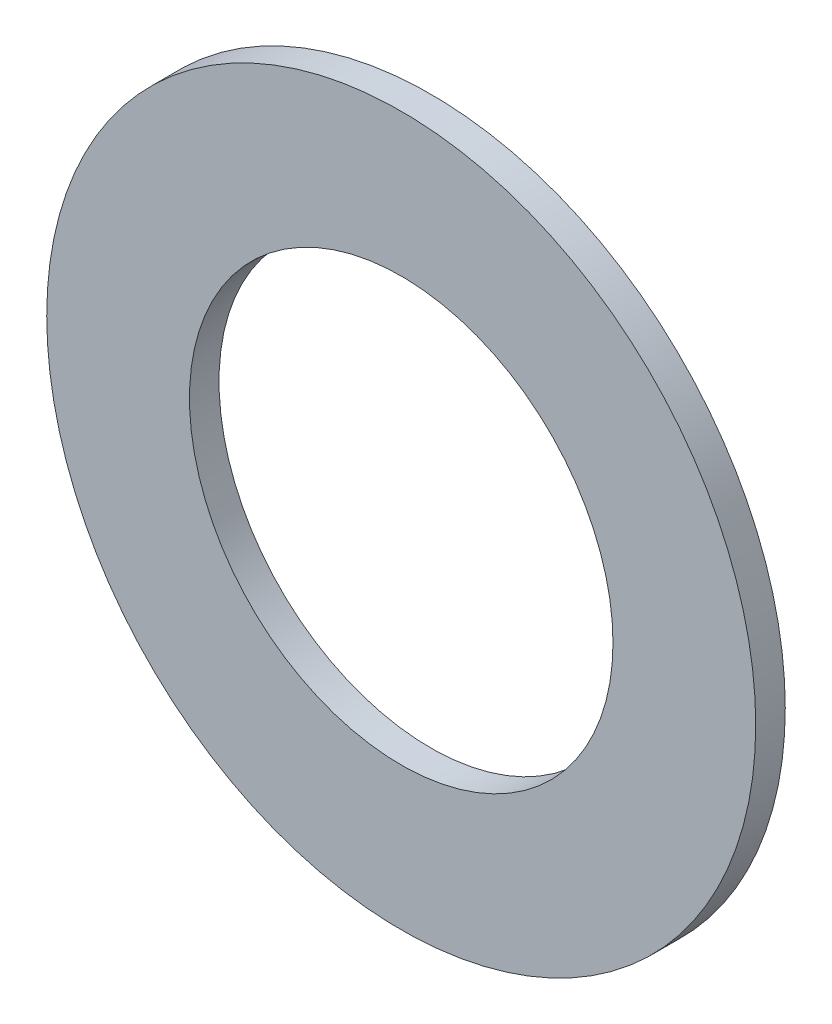
ISO-10303-21;
HEADER;
FILE_DESCRIPTION(('STEP AP214'),'2;1');
FILE_NAME('part.step','',(''),(''),'','','');
FILE_SCHEMA(('AUTOMOTIVE_DESIGN { 1 0 10303 214 1 1 1 1 }'));
ENDSEC;
DATA;
#1=APPLICATION_CONTEXT('core data for automotive mechanical design processes');
#2=APPLICATION_PROTOCOL_DEFINITION('international standard','automotive_design',2000,#1);
#3=PRODUCT_CONTEXT('',#1,'mechanical');
#4=PRODUCT('Part','Part','',(#3));
#5=PRODUCT_RELATED_PRODUCT_CATEGORY('part','',(#4));
#6=PRODUCT_DEFINITION_FORMATION('','',#4);
#7=PRODUCT_DEFINITION_CONTEXT('part definition',#1,'design');
#8=PRODUCT_DEFINITION('design','',#6,#7);
#9=PRODUCT_DEFINITION_SHAPE('','',#8);
#10=(LENGTH_UNIT() NAMED_UNIT(*) SI_UNIT(.MILLI.,.METRE.));
#11=(NAMED_UNIT(*) PLANE_ANGLE_UNIT() SI_UNIT($,.RADIAN.));
#12=(NAMED_UNIT(*) SI_UNIT($,.STERADIAN.) SOLID_ANGLE_UNIT());
#13=UNCERTAINTY_MEASURE_WITH_UNIT(LENGTH_MEASURE(1.E-05),#10,'distance_accuracy_value','');
#14=(GEOMETRIC_REPRESENTATION_CONTEXT(3) GLOBAL_UNCERTAINTY_ASSIGNED_CONTEXT((#13)) GLOBAL_UNIT_ASSIGNED_CONTEXT((#10,
#11,#12)) REPRESENTATION_CONTEXT('',''));
#15=CARTESIAN_POINT('',(0.,0.,0.));
#16=DIRECTION('',(0.,0.,1.));
#17=DIRECTION('',(1.,0.,0.));
#18=AXIS2_PLACEMENT_3D('',#15,#16,#17);
#19=CARTESIAN_POINT('',(0.,0.,0.79375));
#20=DIRECTION('',(0.,0.,1.));
#21=DIRECTION('',(1.,0.,0.));
#22=AXIS2_PLACEMENT_3D('',#19,#20,#21);
#23=PLANE('',#22);
#24=CARTESIAN_POINT('',(0.,0.,0.79375));
#25=DIRECTION('',(0.,0.,1.));
#26=DIRECTION('',(1.,0.,0.));
#27=AXIS2_PLACEMENT_3D('',#24,#25,#26);
#28=CIRCLE('',#27,19.05);
#29=CARTESIAN_POINT('',(19.05,0.,0.79375));
#30=VERTEX_POINT('',#29);
#31=EDGE_CURVE('E10',#30,#30,#28,.T.);
#32=ORIENTED_EDGE('',*,*,#31,.T.);
#33=EDGE_LOOP('',(#32));
#34=FACE_BOUND('',#33,.T.);
#35=CARTESIAN_POINT('',(0.,0.,0.79375));
#36=DIRECTION('',(0.,0.,1.));
#37=DIRECTION('',(1.,0.,0.));
#38=AXIS2_PLACEMENT_3D('',#35,#36,#37);
#39=CIRCLE('',#38,11.3792);
#40=CARTESIAN_POINT('',(11.3792,0.,0.79375));
#41=VERTEX_POINT('',#40);
#42=EDGE_CURVE('E41',#41,#41,#39,.T.);
#43=ORIENTED_EDGE('',*,*,#42,.F.);
#44=EDGE_LOOP('',(#43));
#45=FACE_BOUND('',#44,.T.);
#46=ADVANCED_FACE('F30',(#34,#45),#23,.T.);
#47=CARTESIAN_POINT('',(0.,0.,-0.79375));
#48=DIRECTION('',(0.,0.,1.));
#49=DIRECTION('',(1.,0.,0.));
#50=AXIS2_PLACEMENT_3D('',#47,#48,#49);
#51=PLANE('',#50);
#52=CARTESIAN_POINT('',(0.,0.,-0.79375));
#53=DIRECTION('',(0.,0.,1.));
#54=DIRECTION('',(1.,0.,0.));
#55=AXIS2_PLACEMENT_3D('',#52,#53,#54);
#56=CIRCLE('',#55,19.05);
#57=CARTESIAN_POINT('',(19.05,0.,-0.79375));
#58=VERTEX_POINT('',#57);
#59=EDGE_CURVE('E34',#58,#58,#56,.T.);
#60=ORIENTED_EDGE('',*,*,#59,.F.);
#61=EDGE_LOOP('',(#60));
#62=FACE_BOUND('',#61,.T.);
#63=CARTESIAN_POINT('',(0.,0.,-0.79375));
#64=DIRECTION('',(0.,0.,1.));
#65=DIRECTION('',(1.,0.,0.));
#66=AXIS2_PLACEMENT_3D('',#63,#64,#65);
#67=CIRCLE('',#66,11.3792);
#68=CARTESIAN_POINT('',(11.3792,0.,-0.79375));
#69=VERTEX_POINT('',#68);
#70=EDGE_CURVE('E43',#69,#69,#67,.T.);
#71=ORIENTED_EDGE('',*,*,#70,.T.);
#72=EDGE_LOOP('',(#71));
#73=FACE_BOUND('',#72,.T.);
#74=ADVANCED_FACE('F53',(#62,#73),#51,.F.);
#75=CARTESIAN_POINT('',(0.,0.,0.79375));
#76=DIRECTION('',(0.,0.,-1.));
#77=DIRECTION('',(-1.,0.,0.));
#78=AXIS2_PLACEMENT_3D('',#75,#76,#77);
#79=CYLINDRICAL_SURFACE('',#78,19.05);
#80=ORIENTED_EDGE('',*,*,#31,.F.);
#81=EDGE_LOOP('',(#80));
#82=FACE_BOUND('',#81,.T.);
#83=ORIENTED_EDGE('',*,*,#59,.T.);
#84=EDGE_LOOP('',(#83));
#85=FACE_BOUND('',#84,.T.);
#86=ADVANCED_FACE('F32',(#82,#85),#79,.T.);
#87=CARTESIAN_POINT('',(0.,0.,0.79375));
#88=DIRECTION('',(0.,0.,-1.));
#89=DIRECTION('',(-1.,0.,0.));
#90=AXIS2_PLACEMENT_3D('',#87,#88,#89);
#91=CYLINDRICAL_SURFACE('',#90,11.3792);
#92=ORIENTED_EDGE('',*,*,#42,.T.);
#93=EDGE_LOOP('',(#92));
#94=FACE_BOUND('',#93,.T.);
#95=ORIENTED_EDGE('',*,*,#70,.F.);
#96=EDGE_LOOP('',(#95));
#97=FACE_BOUND('',#96,.T.);
#98=ADVANCED_FACE('F49',(#94,#97),#91,.F.);
#99=CLOSED_SHELL('',(#46,#74,#86,#98));
#100=MANIFOLD_SOLID_BREP('B2',#99);
#101=ADVANCED_BREP_SHAPE_REPRESENTATION('',(#18,#100),#14);
#102=SHAPE_DEFINITION_REPRESENTATION(#9,#101);
ENDSEC;
END-ISO-10303-21;
